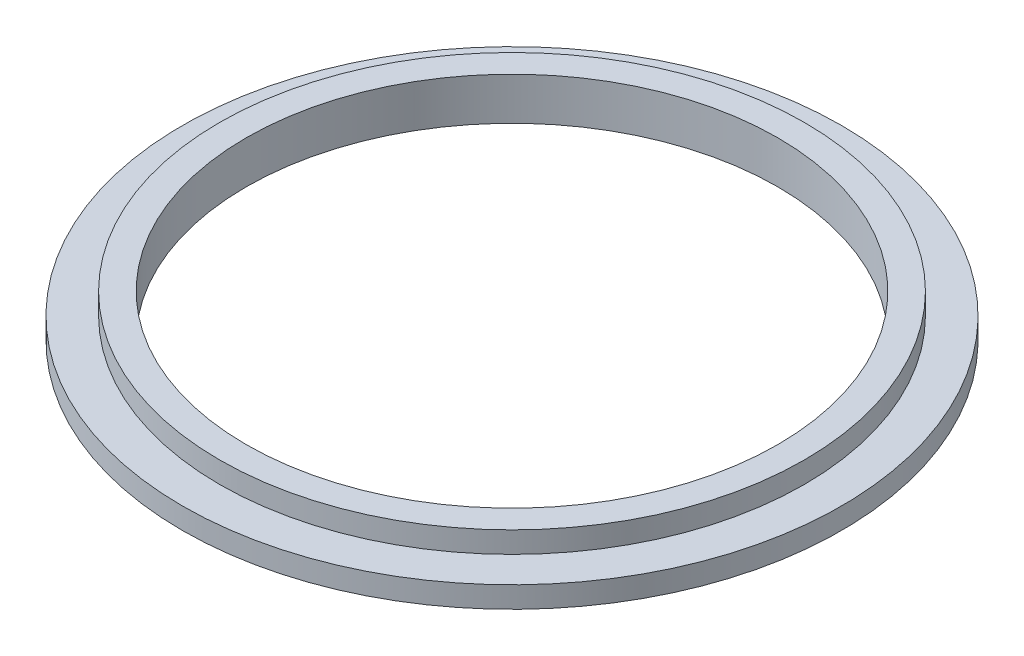
ISO-10303-21;
HEADER;
FILE_DESCRIPTION(('STEP AP214'),'2;1');
FILE_NAME('part.step','',(''),(''),'','','');
FILE_SCHEMA(('AUTOMOTIVE_DESIGN { 1 0 10303 214 1 1 1 1 }'));
ENDSEC;
DATA;
#1=APPLICATION_CONTEXT('core data for automotive mechanical design processes');
#2=APPLICATION_PROTOCOL_DEFINITION('international standard','automotive_design',2000,#1);
#3=PRODUCT_CONTEXT('',#1,'mechanical');
#4=PRODUCT('Part','Part','',(#3));
#5=PRODUCT_RELATED_PRODUCT_CATEGORY('part','',(#4));
#6=PRODUCT_DEFINITION_FORMATION('','',#4);
#7=PRODUCT_DEFINITION_CONTEXT('part definition',#1,'design');
#8=PRODUCT_DEFINITION('design','',#6,#7);
#9=PRODUCT_DEFINITION_SHAPE('','',#8);
#10=(LENGTH_UNIT() NAMED_UNIT(*) SI_UNIT(.MILLI.,.METRE.));
#11=(NAMED_UNIT(*) PLANE_ANGLE_UNIT() SI_UNIT($,.RADIAN.));
#12=(NAMED_UNIT(*) SI_UNIT($,.STERADIAN.) SOLID_ANGLE_UNIT());
#13=UNCERTAINTY_MEASURE_WITH_UNIT(LENGTH_MEASURE(1.E-05),#10,'distance_accuracy_value','');
#14=(GEOMETRIC_REPRESENTATION_CONTEXT(3) GLOBAL_UNCERTAINTY_ASSIGNED_CONTEXT((#13)) GLOBAL_UNIT_ASSIGNED_CONTEXT((#10,
#11,#12)) REPRESENTATION_CONTEXT('',''));
#15=CARTESIAN_POINT('',(0.,0.,0.));
#16=DIRECTION('',(0.,0.,1.));
#17=DIRECTION('',(1.,0.,0.));
#18=AXIS2_PLACEMENT_3D('',#15,#16,#17);
#19=CARTESIAN_POINT('',(0.,20.,0.));
#20=DIRECTION('',(0.,1.,0.));
#21=DIRECTION('',(0.,0.,1.));
#22=AXIS2_PLACEMENT_3D('',#19,#20,#21);
#23=PLANE('',#22);
#24=CARTESIAN_POINT('',(0.,20.,0.));
#25=DIRECTION('',(0.,1.,0.));
#26=DIRECTION('',(0.,0.,1.));
#27=AXIS2_PLACEMENT_3D('',#24,#25,#26);
#28=CIRCLE('',#27,310.);
#29=CARTESIAN_POINT('',(0.,20.,310.));
#30=VERTEX_POINT('',#29);
#31=EDGE_CURVE('E10',#30,#30,#28,.T.);
#32=ORIENTED_EDGE('',*,*,#31,.T.);
#33=EDGE_LOOP('',(#32));
#34=FACE_BOUND('',#33,.T.);
#35=CARTESIAN_POINT('',(0.,20.,0.));
#36=DIRECTION('',(0.,1.,0.));
#37=DIRECTION('',(0.,0.,1.));
#38=AXIS2_PLACEMENT_3D('',#35,#36,#37);
#39=CIRCLE('',#38,275.);
#40=CARTESIAN_POINT('',(0.,20.,275.));
#41=VERTEX_POINT('',#40);
#42=EDGE_CURVE('E47',#41,#41,#39,.T.);
#43=ORIENTED_EDGE('',*,*,#42,.F.);
#44=EDGE_LOOP('',(#43));
#45=FACE_BOUND('',#44,.T.);
#46=ADVANCED_FACE('F31',(#34,#45),#23,.T.);
#47=CARTESIAN_POINT('',(0.,0.,0.));
#48=DIRECTION('',(0.,1.,0.));
#49=DIRECTION('',(0.,0.,1.));
#50=AXIS2_PLACEMENT_3D('',#47,#48,#49);
#51=PLANE('',#50);
#52=CARTESIAN_POINT('',(0.,0.,0.));
#53=DIRECTION('',(0.,1.,0.));
#54=DIRECTION('',(0.,0.,1.));
#55=AXIS2_PLACEMENT_3D('',#52,#53,#54);
#56=CIRCLE('',#55,310.);
#57=CARTESIAN_POINT('',(0.,0.,310.));
#58=VERTEX_POINT('',#57);
#59=EDGE_CURVE('E35',#58,#58,#56,.T.);
#60=ORIENTED_EDGE('',*,*,#59,.F.);
#61=EDGE_LOOP('',(#60));
#62=FACE_BOUND('',#61,.T.);
#63=CARTESIAN_POINT('',(0.,0.,0.));
#64=DIRECTION('',(0.,1.,0.));
#65=DIRECTION('',(0.,0.,1.));
#66=AXIS2_PLACEMENT_3D('',#63,#64,#65);
#67=CIRCLE('',#66,250.);
#68=CARTESIAN_POINT('',(0.,0.,250.));
#69=VERTEX_POINT('',#68);
#70=EDGE_CURVE('E42',#69,#69,#67,.T.);
#71=ORIENTED_EDGE('',*,*,#70,.T.);
#72=EDGE_LOOP('',(#71));
#73=FACE_BOUND('',#72,.T.);
#74=ADVANCED_FACE('F72',(#62,#73),#51,.F.);
#75=CARTESIAN_POINT('',(0.,20.,0.));
#76=DIRECTION('',(0.,-1.,0.));
#77=DIRECTION('',(0.,0.,-1.));
#78=AXIS2_PLACEMENT_3D('',#75,#76,#77);
#79=CYLINDRICAL_SURFACE('',#78,310.);
#80=ORIENTED_EDGE('',*,*,#31,.F.);
#81=EDGE_LOOP('',(#80));
#82=FACE_BOUND('',#81,.T.);
#83=ORIENTED_EDGE('',*,*,#59,.T.);
#84=EDGE_LOOP('',(#83));
#85=FACE_BOUND('',#84,.T.);
#86=ADVANCED_FACE('F33',(#82,#85),#79,.T.);
#87=CARTESIAN_POINT('',(0.,20.,0.));
#88=DIRECTION('',(0.,-1.,0.));
#89=DIRECTION('',(0.,0.,-1.));
#90=AXIS2_PLACEMENT_3D('',#87,#88,#89);
#91=CYLINDRICAL_SURFACE('',#90,250.);
#92=ORIENTED_EDGE('',*,*,#70,.F.);
#93=EDGE_LOOP('',(#92));
#94=FACE_BOUND('',#93,.T.);
#95=CARTESIAN_POINT('',(0.,40.,0.));
#96=DIRECTION('',(0.,1.,0.));
#97=DIRECTION('',(0.,0.,1.));
#98=AXIS2_PLACEMENT_3D('',#95,#96,#97);
#99=CIRCLE('',#98,250.);
#100=CARTESIAN_POINT('',(0.,40.,250.));
#101=VERTEX_POINT('',#100);
#102=EDGE_CURVE('E50',#101,#101,#99,.T.);
#103=ORIENTED_EDGE('',*,*,#102,.T.);
#104=EDGE_LOOP('',(#103));
#105=FACE_BOUND('',#104,.T.);
#106=ADVANCED_FACE('F56',(#94,#105),#91,.F.);
#107=CARTESIAN_POINT('',(0.,40.,0.));
#108=DIRECTION('',(0.,1.,0.));
#109=DIRECTION('',(0.,0.,1.));
#110=AXIS2_PLACEMENT_3D('',#107,#108,#109);
#111=PLANE('',#110);
#112=CARTESIAN_POINT('',(0.,40.,0.));
#113=DIRECTION('',(0.,1.,0.));
#114=DIRECTION('',(0.,0.,1.));
#115=AXIS2_PLACEMENT_3D('',#112,#113,#114);
#116=CIRCLE('',#115,275.);
#117=CARTESIAN_POINT('',(0.,40.,275.));
#118=VERTEX_POINT('',#117);
#119=EDGE_CURVE('E46',#118,#118,#116,.T.);
#120=ORIENTED_EDGE('',*,*,#119,.T.);
#121=EDGE_LOOP('',(#120));
#122=FACE_BOUND('',#121,.T.);
#123=ORIENTED_EDGE('',*,*,#102,.F.);
#124=EDGE_LOOP('',(#123));
#125=FACE_BOUND('',#124,.T.);
#126=ADVANCED_FACE('F58',(#122,#125),#111,.T.);
#127=CARTESIAN_POINT('',(0.,40.,0.));
#128=DIRECTION('',(0.,-1.,0.));
#129=DIRECTION('',(0.,0.,-1.));
#130=AXIS2_PLACEMENT_3D('',#127,#128,#129);
#131=CYLINDRICAL_SURFACE('',#130,275.);
#132=ORIENTED_EDGE('',*,*,#119,.F.);
#133=EDGE_LOOP('',(#132));
#134=FACE_BOUND('',#133,.T.);
#135=ORIENTED_EDGE('',*,*,#42,.T.);
#136=EDGE_LOOP('',(#135));
#137=FACE_BOUND('',#136,.T.);
#138=ADVANCED_FACE('F60',(#134,#137),#131,.T.);
#139=CLOSED_SHELL('',(#46,#74,#86,#106,#126,#138));
#140=MANIFOLD_SOLID_BREP('B2',#139);
#141=ADVANCED_BREP_SHAPE_REPRESENTATION('',(#18,#140),#14);
#142=SHAPE_DEFINITION_REPRESENTATION(#9,#141);
ENDSEC;
END-ISO-10303-21;
